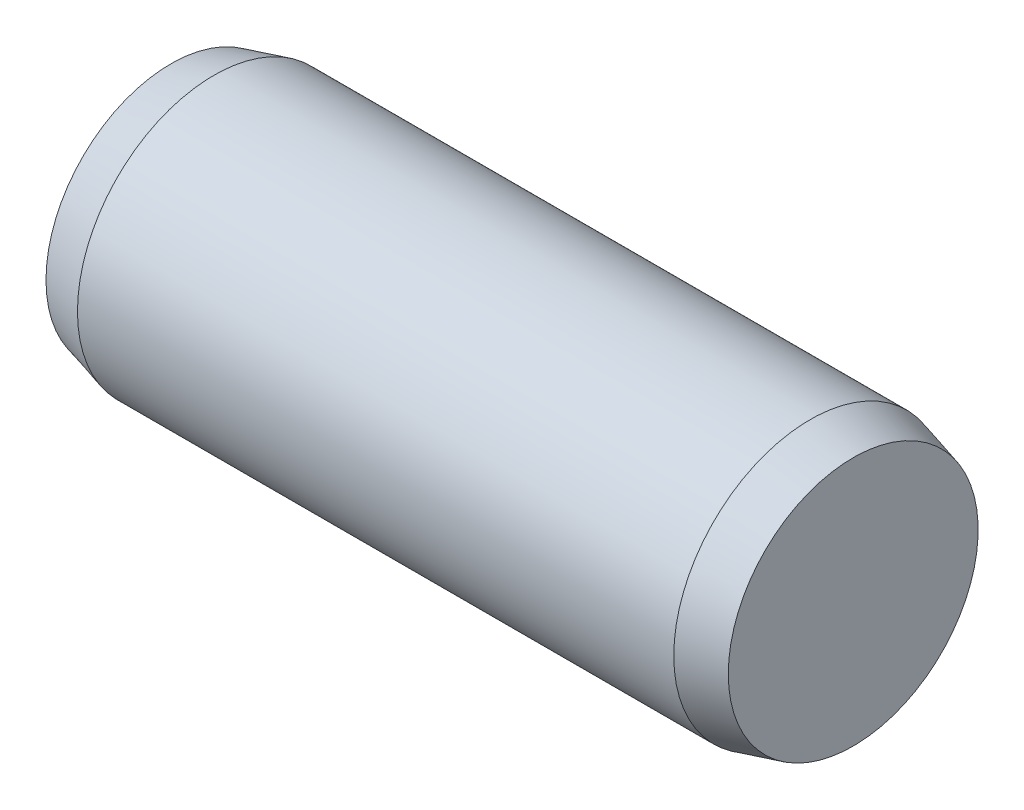
ISO-10303-21;
HEADER;
FILE_DESCRIPTION(('STEP AP214'),'2;1');
FILE_NAME('part.step','',(''),(''),'','','');
FILE_SCHEMA(('AUTOMOTIVE_DESIGN { 1 0 10303 214 1 1 1 1 }'));
ENDSEC;
DATA;
#1=APPLICATION_CONTEXT('core data for automotive mechanical design processes');
#2=APPLICATION_PROTOCOL_DEFINITION('international standard','automotive_design',2000,#1);
#3=PRODUCT_CONTEXT('',#1,'mechanical');
#4=PRODUCT('Part','Part','',(#3));
#5=PRODUCT_RELATED_PRODUCT_CATEGORY('part','',(#4));
#6=PRODUCT_DEFINITION_FORMATION('','',#4);
#7=PRODUCT_DEFINITION_CONTEXT('part definition',#1,'design');
#8=PRODUCT_DEFINITION('design','',#6,#7);
#9=PRODUCT_DEFINITION_SHAPE('','',#8);
#10=(LENGTH_UNIT() NAMED_UNIT(*) SI_UNIT(.MILLI.,.METRE.));
#11=(NAMED_UNIT(*) PLANE_ANGLE_UNIT() SI_UNIT($,.RADIAN.));
#12=(NAMED_UNIT(*) SI_UNIT($,.STERADIAN.) SOLID_ANGLE_UNIT());
#13=UNCERTAINTY_MEASURE_WITH_UNIT(LENGTH_MEASURE(1.E-05),#10,'distance_accuracy_value','');
#14=(GEOMETRIC_REPRESENTATION_CONTEXT(3) GLOBAL_UNCERTAINTY_ASSIGNED_CONTEXT((#13)) GLOBAL_UNIT_ASSIGNED_CONTEXT((#10,
#11,#12)) REPRESENTATION_CONTEXT('',''));
#15=CARTESIAN_POINT('',(0.,0.,0.));
#16=DIRECTION('',(0.,0.,1.));
#17=DIRECTION('',(1.,0.,0.));
#18=AXIS2_PLACEMENT_3D('',#15,#16,#17);
#19=CARTESIAN_POINT('',(0.,1.8311920087684,0.));
#20=DIRECTION('',(1.,0.,0.));
#21=DIRECTION('',(0.,0.,-1.));
#22=AXIS2_PLACEMENT_3D('',#19,#20,#21);
#23=PLANE('',#22);
#24=CARTESIAN_POINT('',(0.,0.,0.));
#25=DIRECTION('',(-1.,0.,0.));
#26=DIRECTION('',(0.,0.,1.));
#27=AXIS2_PLACEMENT_3D('',#24,#25,#26);
#28=CIRCLE('',#27,1.8311920087684);
#29=CARTESIAN_POINT('',(0.,0.,1.8311920087684));
#30=VERTEX_POINT('',#29);
#31=EDGE_CURVE('E10',#30,#30,#28,.T.);
#32=ORIENTED_EDGE('',*,*,#31,.T.);
#33=EDGE_LOOP('',(#32));
#34=FACE_BOUND('',#33,.T.);
#35=ADVANCED_FACE('F32',(#34),#23,.F.);
#36=CARTESIAN_POINT('',(0.63,0.,0.));
#37=DIRECTION('',(1.,0.,0.));
#38=DIRECTION('',(0.,0.,-1.));
#39=AXIS2_PLACEMENT_3D('',#36,#37,#38);
#40=CONICAL_SURFACE('',#39,2.,0.261799387799143);
#41=ORIENTED_EDGE('',*,*,#31,.F.);
#42=EDGE_LOOP('',(#41));
#43=FACE_BOUND('',#42,.T.);
#44=CARTESIAN_POINT('',(0.63,0.,0.));
#45=DIRECTION('',(-1.,0.,0.));
#46=DIRECTION('',(0.,0.,1.));
#47=AXIS2_PLACEMENT_3D('',#44,#45,#46);
#48=CIRCLE('',#47,2.);
#49=CARTESIAN_POINT('',(0.63,0.,2.));
#50=VERTEX_POINT('',#49);
#51=EDGE_CURVE('E38',#50,#50,#48,.T.);
#52=ORIENTED_EDGE('',*,*,#51,.T.);
#53=EDGE_LOOP('',(#52));
#54=FACE_BOUND('',#53,.T.);
#55=ADVANCED_FACE('F64',(#43,#54),#40,.T.);
#56=CARTESIAN_POINT('',(-6.35,0.,0.));
#57=DIRECTION('',(-1.,0.,0.));
#58=DIRECTION('',(0.,0.,1.));
#59=AXIS2_PLACEMENT_3D('',#56,#57,#58);
#60=CYLINDRICAL_SURFACE('',#59,2.);
#61=ORIENTED_EDGE('',*,*,#51,.F.);
#62=EDGE_LOOP('',(#61));
#63=FACE_BOUND('',#62,.T.);
#64=CARTESIAN_POINT('',(9.37,0.,0.));
#65=DIRECTION('',(-1.,0.,0.));
#66=DIRECTION('',(0.,0.,1.));
#67=AXIS2_PLACEMENT_3D('',#64,#65,#66);
#68=CIRCLE('',#67,2.);
#69=CARTESIAN_POINT('',(9.37,0.,2.));
#70=VERTEX_POINT('',#69);
#71=EDGE_CURVE('E42',#70,#70,#68,.T.);
#72=ORIENTED_EDGE('',*,*,#71,.T.);
#73=EDGE_LOOP('',(#72));
#74=FACE_BOUND('',#73,.T.);
#75=ADVANCED_FACE('F60',(#63,#74),#60,.T.);
#76=CARTESIAN_POINT('',(10.,0.,0.));
#77=DIRECTION('',(-1.,0.,0.));
#78=DIRECTION('',(0.,0.,1.));
#79=AXIS2_PLACEMENT_3D('',#76,#77,#78);
#80=CONICAL_SURFACE('',#79,1.83119200876839,0.26179938779915);
#81=ORIENTED_EDGE('',*,*,#71,.F.);
#82=EDGE_LOOP('',(#81));
#83=FACE_BOUND('',#82,.T.);
#84=CARTESIAN_POINT('',(10.,0.,0.));
#85=DIRECTION('',(-1.,0.,0.));
#86=DIRECTION('',(0.,0.,1.));
#87=AXIS2_PLACEMENT_3D('',#84,#85,#86);
#88=CIRCLE('',#87,1.83119200876839);
#89=CARTESIAN_POINT('',(10.,0.,1.83119200876839));
#90=VERTEX_POINT('',#89);
#91=EDGE_CURVE('E46',#90,#90,#88,.T.);
#92=ORIENTED_EDGE('',*,*,#91,.T.);
#93=EDGE_LOOP('',(#92));
#94=FACE_BOUND('',#93,.T.);
#95=ADVANCED_FACE('F52',(#83,#94),#80,.T.);
#96=CARTESIAN_POINT('',(10.,0.,0.));
#97=DIRECTION('',(-1.,0.,0.));
#98=DIRECTION('',(0.,0.,1.));
#99=AXIS2_PLACEMENT_3D('',#96,#97,#98);
#100=PLANE('',#99);
#101=ORIENTED_EDGE('',*,*,#91,.F.);
#102=EDGE_LOOP('',(#101));
#103=FACE_BOUND('',#102,.T.);
#104=ADVANCED_FACE('F54',(#103),#100,.F.);
#105=CLOSED_SHELL('',(#35,#55,#75,#95,#104));
#106=MANIFOLD_SOLID_BREP('B2',#105);
#107=ADVANCED_BREP_SHAPE_REPRESENTATION('',(#18,#106),#14);
#108=SHAPE_DEFINITION_REPRESENTATION(#9,#107);
ENDSEC;
END-ISO-10303-21;
